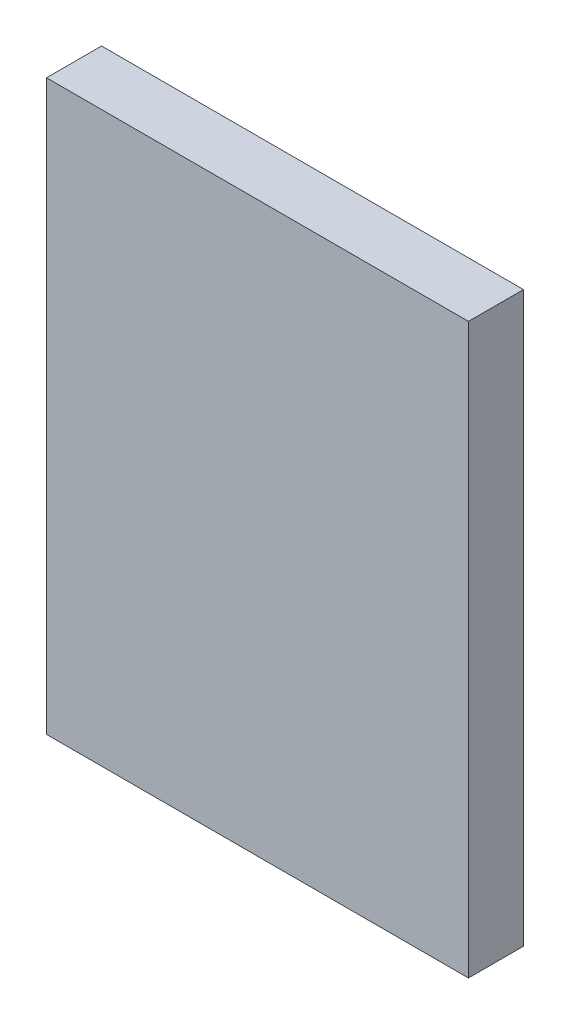
ISO-10303-21;
HEADER;
FILE_DESCRIPTION(('STEP AP214'),'2;1');
FILE_NAME('part.step','',(''),(''),'','','');
FILE_SCHEMA(('AUTOMOTIVE_DESIGN { 1 0 10303 214 1 1 1 1 }'));
ENDSEC;
DATA;
#1=APPLICATION_CONTEXT('core data for automotive mechanical design processes');
#2=APPLICATION_PROTOCOL_DEFINITION('international standard','automotive_design',2000,#1);
#3=PRODUCT_CONTEXT('',#1,'mechanical');
#4=PRODUCT('Part','Part','',(#3));
#5=PRODUCT_RELATED_PRODUCT_CATEGORY('part','',(#4));
#6=PRODUCT_DEFINITION_FORMATION('','',#4);
#7=PRODUCT_DEFINITION_CONTEXT('part definition',#1,'design');
#8=PRODUCT_DEFINITION('design','',#6,#7);
#9=PRODUCT_DEFINITION_SHAPE('','',#8);
#10=(LENGTH_UNIT() NAMED_UNIT(*) SI_UNIT(.MILLI.,.METRE.));
#11=(NAMED_UNIT(*) PLANE_ANGLE_UNIT() SI_UNIT($,.RADIAN.));
#12=(NAMED_UNIT(*) SI_UNIT($,.STERADIAN.) SOLID_ANGLE_UNIT());
#13=UNCERTAINTY_MEASURE_WITH_UNIT(LENGTH_MEASURE(1.E-05),#10,'distance_accuracy_value','');
#14=(GEOMETRIC_REPRESENTATION_CONTEXT(3) GLOBAL_UNCERTAINTY_ASSIGNED_CONTEXT((#13)) GLOBAL_UNIT_ASSIGNED_CONTEXT((#10,
#11,#12)) REPRESENTATION_CONTEXT('',''));
#15=CARTESIAN_POINT('',(0.,0.,0.));
#16=DIRECTION('',(0.,0.,1.));
#17=DIRECTION('',(1.,0.,0.));
#18=AXIS2_PLACEMENT_3D('',#15,#16,#17);
#19=CARTESIAN_POINT('',(11.5,15.5,3.));
#20=DIRECTION('',(-1.,0.,0.));
#21=DIRECTION('',(0.,-1.,0.));
#22=AXIS2_PLACEMENT_3D('',#19,#20,#21);
#23=PLANE('',#22);
#24=DIRECTION('',(0.,1.,0.));
#25=VECTOR('',#24,1.);
#26=CARTESIAN_POINT('',(11.5,15.5,0.));
#27=LINE('',#26,#25);
#28=CARTESIAN_POINT('',(11.5,-15.5,0.));
#29=VERTEX_POINT('',#28);
#30=CARTESIAN_POINT('',(11.5,15.5,0.));
#31=VERTEX_POINT('',#30);
#32=EDGE_CURVE('E96',#29,#31,#27,.T.);
#33=ORIENTED_EDGE('',*,*,#32,.T.);
#34=DIRECTION('',(0.,0.,-1.));
#35=VECTOR('',#34,1.);
#36=CARTESIAN_POINT('',(11.5,15.5,3.));
#37=LINE('',#36,#35);
#38=CARTESIAN_POINT('',(11.5,15.5,3.));
#39=VERTEX_POINT('',#38);
#40=EDGE_CURVE('E11',#39,#31,#37,.T.);
#41=ORIENTED_EDGE('',*,*,#40,.F.);
#42=DIRECTION('',(0.,1.,0.));
#43=VECTOR('',#42,1.);
#44=CARTESIAN_POINT('',(11.5,15.5,3.));
#45=LINE('',#44,#43);
#46=CARTESIAN_POINT('',(11.5,-15.5,3.));
#47=VERTEX_POINT('',#46);
#48=EDGE_CURVE('E84',#47,#39,#45,.T.);
#49=ORIENTED_EDGE('',*,*,#48,.F.);
#50=DIRECTION('',(0.,0.,-1.));
#51=VECTOR('',#50,1.);
#52=CARTESIAN_POINT('',(11.5,-15.5,3.));
#53=LINE('',#52,#51);
#54=EDGE_CURVE('E92',#47,#29,#53,.T.);
#55=ORIENTED_EDGE('',*,*,#54,.T.);
#56=EDGE_LOOP('',(#33,#41,#49,#55));
#57=FACE_BOUND('',#56,.T.);
#58=ADVANCED_FACE('F33',(#57),#23,.F.);
#59=CARTESIAN_POINT('',(-11.5,15.5,3.));
#60=DIRECTION('',(0.,-1.,0.));
#61=DIRECTION('',(0.,0.,-1.));
#62=AXIS2_PLACEMENT_3D('',#59,#60,#61);
#63=PLANE('',#62);
#64=DIRECTION('',(-1.,0.,0.));
#65=VECTOR('',#64,1.);
#66=CARTESIAN_POINT('',(-11.5,15.5,0.));
#67=LINE('',#66,#65);
#68=CARTESIAN_POINT('',(-11.5,15.5,0.));
#69=VERTEX_POINT('',#68);
#70=EDGE_CURVE('E88',#31,#69,#67,.T.);
#71=ORIENTED_EDGE('',*,*,#70,.T.);
#72=DIRECTION('',(0.,0.,-1.));
#73=VECTOR('',#72,1.);
#74=CARTESIAN_POINT('',(-11.5,15.5,3.));
#75=LINE('',#74,#73);
#76=CARTESIAN_POINT('',(-11.5,15.5,3.));
#77=VERTEX_POINT('',#76);
#78=EDGE_CURVE('E41',#77,#69,#75,.T.);
#79=ORIENTED_EDGE('',*,*,#78,.F.);
#80=DIRECTION('',(-1.,0.,0.));
#81=VECTOR('',#80,1.);
#82=CARTESIAN_POINT('',(-11.5,15.5,3.));
#83=LINE('',#82,#81);
#84=EDGE_CURVE('E79',#39,#77,#83,.T.);
#85=ORIENTED_EDGE('',*,*,#84,.F.);
#86=ORIENTED_EDGE('',*,*,#40,.T.);
#87=EDGE_LOOP('',(#71,#79,#85,#86));
#88=FACE_BOUND('',#87,.T.);
#89=ADVANCED_FACE('F87',(#88),#63,.F.);
#90=CARTESIAN_POINT('',(-11.5,15.5,3.));
#91=DIRECTION('',(1.,0.,0.));
#92=DIRECTION('',(0.,1.,0.));
#93=AXIS2_PLACEMENT_3D('',#90,#91,#92);
#94=PLANE('',#93);
#95=DIRECTION('',(0.,-1.,0.));
#96=VECTOR('',#95,1.);
#97=CARTESIAN_POINT('',(-11.5,15.5,0.));
#98=LINE('',#97,#96);
#99=CARTESIAN_POINT('',(-11.5,-15.5,0.));
#100=VERTEX_POINT('',#99);
#101=EDGE_CURVE('E66',#69,#100,#98,.T.);
#102=ORIENTED_EDGE('',*,*,#101,.T.);
#103=DIRECTION('',(0.,0.,-1.));
#104=VECTOR('',#103,1.);
#105=CARTESIAN_POINT('',(-11.5,-15.5,3.));
#106=LINE('',#105,#104);
#107=CARTESIAN_POINT('',(-11.5,-15.5,3.));
#108=VERTEX_POINT('',#107);
#109=EDGE_CURVE('E89',#108,#100,#106,.T.);
#110=ORIENTED_EDGE('',*,*,#109,.F.);
#111=DIRECTION('',(0.,-1.,0.));
#112=VECTOR('',#111,1.);
#113=CARTESIAN_POINT('',(-11.5,15.5,3.));
#114=LINE('',#113,#112);
#115=EDGE_CURVE('E82',#77,#108,#114,.T.);
#116=ORIENTED_EDGE('',*,*,#115,.F.);
#117=ORIENTED_EDGE('',*,*,#78,.T.);
#118=EDGE_LOOP('',(#102,#110,#116,#117));
#119=FACE_BOUND('',#118,.T.);
#120=ADVANCED_FACE('F90',(#119),#94,.F.);
#121=CARTESIAN_POINT('',(-11.5,-15.5,3.));
#122=DIRECTION('',(0.,1.,0.));
#123=DIRECTION('',(0.,0.,1.));
#124=AXIS2_PLACEMENT_3D('',#121,#122,#123);
#125=PLANE('',#124);
#126=DIRECTION('',(1.,0.,0.));
#127=VECTOR('',#126,1.);
#128=CARTESIAN_POINT('',(-11.5,-15.5,0.));
#129=LINE('',#128,#127);
#130=EDGE_CURVE('E72',#100,#29,#129,.T.);
#131=ORIENTED_EDGE('',*,*,#130,.T.);
#132=ORIENTED_EDGE('',*,*,#54,.F.);
#133=DIRECTION('',(1.,0.,0.));
#134=VECTOR('',#133,1.);
#135=CARTESIAN_POINT('',(-11.5,-15.5,3.));
#136=LINE('',#135,#134);
#137=EDGE_CURVE('E49',#108,#47,#136,.T.);
#138=ORIENTED_EDGE('',*,*,#137,.F.);
#139=ORIENTED_EDGE('',*,*,#109,.T.);
#140=EDGE_LOOP('',(#131,#132,#138,#139));
#141=FACE_BOUND('',#140,.T.);
#142=ADVANCED_FACE('F103',(#141),#125,.F.);
#143=CARTESIAN_POINT('',(0.,0.,3.));
#144=DIRECTION('',(0.,0.,1.));
#145=DIRECTION('',(1.,0.,0.));
#146=AXIS2_PLACEMENT_3D('',#143,#144,#145);
#147=PLANE('',#146);
#148=ORIENTED_EDGE('',*,*,#48,.T.);
#149=ORIENTED_EDGE('',*,*,#84,.T.);
#150=ORIENTED_EDGE('',*,*,#115,.T.);
#151=ORIENTED_EDGE('',*,*,#137,.T.);
#152=EDGE_LOOP('',(#148,#149,#150,#151));
#153=FACE_BOUND('',#152,.T.);
#154=ADVANCED_FACE('F80',(#153),#147,.T.);
#155=CARTESIAN_POINT('',(0.,0.,0.));
#156=DIRECTION('',(0.,0.,1.));
#157=DIRECTION('',(1.,0.,0.));
#158=AXIS2_PLACEMENT_3D('',#155,#156,#157);
#159=PLANE('',#158);
#160=ORIENTED_EDGE('',*,*,#32,.F.);
#161=ORIENTED_EDGE('',*,*,#130,.F.);
#162=ORIENTED_EDGE('',*,*,#101,.F.);
#163=ORIENTED_EDGE('',*,*,#70,.F.);
#164=EDGE_LOOP('',(#160,#161,#162,#163));
#165=FACE_BOUND('',#164,.T.);
#166=ADVANCED_FACE('F106',(#165),#159,.F.);
#167=CLOSED_SHELL('',(#58,#89,#120,#142,#154,#166));
#168=MANIFOLD_SOLID_BREP('B2',#167);
#169=ADVANCED_BREP_SHAPE_REPRESENTATION('',(#18,#168),#14);
#170=SHAPE_DEFINITION_REPRESENTATION(#9,#169);
ENDSEC;
END-ISO-10303-21;
